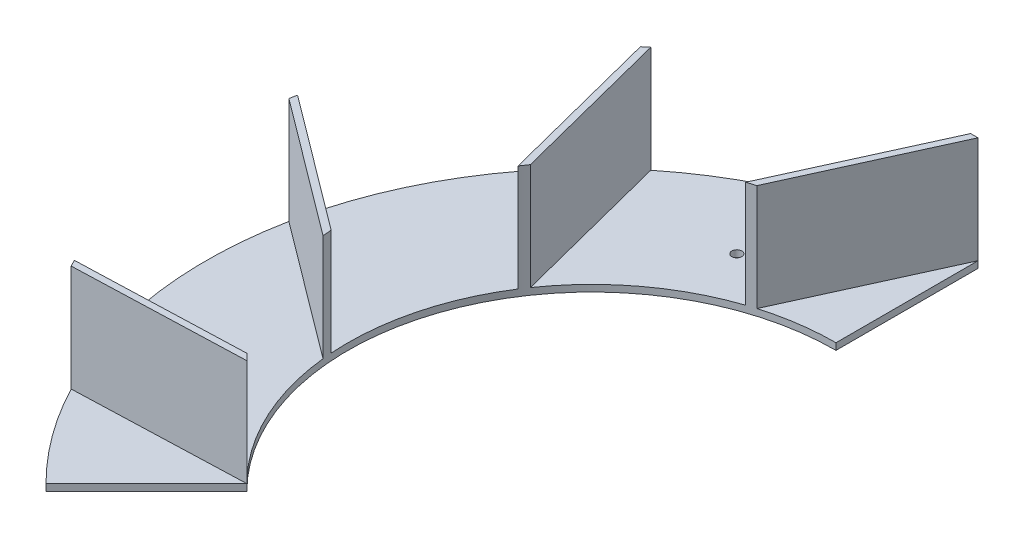
ISO-10303-21;
HEADER;
FILE_DESCRIPTION(('STEP AP214'),'2;1');
FILE_NAME('part.step','',(''),(''),'','','');
FILE_SCHEMA(('AUTOMOTIVE_DESIGN { 1 0 10303 214 1 1 1 1 }'));
ENDSEC;
DATA;
#1=APPLICATION_CONTEXT('core data for automotive mechanical design processes');
#2=APPLICATION_PROTOCOL_DEFINITION('international standard','automotive_design',2000,#1);
#3=PRODUCT_CONTEXT('',#1,'mechanical');
#4=PRODUCT('Part','Part','',(#3));
#5=PRODUCT_RELATED_PRODUCT_CATEGORY('part','',(#4));
#6=PRODUCT_DEFINITION_FORMATION('','',#4);
#7=PRODUCT_DEFINITION_CONTEXT('part definition',#1,'design');
#8=PRODUCT_DEFINITION('design','',#6,#7);
#9=PRODUCT_DEFINITION_SHAPE('','',#8);
#10=(LENGTH_UNIT() NAMED_UNIT(*) SI_UNIT(.MILLI.,.METRE.));
#11=(NAMED_UNIT(*) PLANE_ANGLE_UNIT() SI_UNIT($,.RADIAN.));
#12=(NAMED_UNIT(*) SI_UNIT($,.STERADIAN.) SOLID_ANGLE_UNIT());
#13=UNCERTAINTY_MEASURE_WITH_UNIT(LENGTH_MEASURE(1.E-05),#10,'distance_accuracy_value','');
#14=(GEOMETRIC_REPRESENTATION_CONTEXT(3) GLOBAL_UNCERTAINTY_ASSIGNED_CONTEXT((#13)) GLOBAL_UNIT_ASSIGNED_CONTEXT((#10,
#11,#12)) REPRESENTATION_CONTEXT('',''));
#15=CARTESIAN_POINT('',(0.,0.,0.));
#16=DIRECTION('',(0.,0.,1.));
#17=DIRECTION('',(1.,0.,0.));
#18=AXIS2_PLACEMENT_3D('',#15,#16,#17);
#19=CARTESIAN_POINT('',(0.,3.,0.));
#20=DIRECTION('',(0.,1.,0.));
#21=DIRECTION('',(0.,0.,1.));
#22=AXIS2_PLACEMENT_3D('',#19,#20,#21);
#23=PLANE('',#22);
#24=DIRECTION('',(0.707106781186548,0.,-0.707106781186548));
#25=VECTOR('',#24,1.);
#26=CARTESIAN_POINT('',(-123.036579926459,3.,123.036579926459));
#27=LINE('',#26,#25);
#28=CARTESIAN_POINT('',(-123.036579926459,3.,123.036579926459));
#29=VERTEX_POINT('',#28);
#30=CARTESIAN_POINT('',(-77.7817459305202,3.,77.7817459305202));
#31=VERTEX_POINT('',#30);
#32=EDGE_CURVE('E278',#29,#31,#27,.T.);
#33=ORIENTED_EDGE('',*,*,#32,.T.);
#34=DIRECTION('',(0.999396208274499,0.,-0.0347450555698799));
#35=VECTOR('',#34,1.);
#36=CARTESIAN_POINT('',(-77.7817459305202,3.,77.7817459305202));
#37=LINE('',#36,#35);
#38=CARTESIAN_POINT('',(-154.289169818506,3.,80.4416066268961));
#39=VERTEX_POINT('',#38);
#40=EDGE_CURVE('E50',#39,#31,#37,.T.);
#41=ORIENTED_EDGE('',*,*,#40,.F.);
#42=CARTESIAN_POINT('',(0.,3.,0.));
#43=DIRECTION('',(0.,1.,0.));
#44=DIRECTION('',(0.,0.,1.));
#45=AXIS2_PLACEMENT_3D('',#42,#43,#44);
#46=CIRCLE('',#45,174.);
#47=EDGE_CURVE('E190',#39,#29,#46,.T.);
#48=ORIENTED_EDGE('',*,*,#47,.T.);
#49=EDGE_LOOP('',(#33,#41,#48));
#50=FACE_BOUND('',#49,.T.);
#51=ADVANCED_FACE('F35',(#50),#23,.T.);
#52=CARTESIAN_POINT('',(-130.399986549024,3.,34.9405710888408));
#53=DIRECTION('',(0.,1.,0.));
#54=DIRECTION('',(0.,0.,1.));
#55=AXIS2_PLACEMENT_3D('',#52,#53,#54);
#56=CIRCLE('',#55,2.25000000000001);
#57=CARTESIAN_POINT('',(-130.399986549024,3.,37.1905710888408));
#58=VERTEX_POINT('',#57);
#59=EDGE_CURVE('E410',#58,#58,#56,.F.);
#60=ORIENTED_EDGE('',*,*,#59,.T.);
#61=EDGE_LOOP('',(#60));
#62=FACE_BOUND('',#61,.T.);
#63=CARTESIAN_POINT('',(-170.63929418909,3.,-34.0327971029312));
#64=VERTEX_POINT('',#63);
#65=CARTESIAN_POINT('',(-155.791483301564,3.,77.4920236585584));
#66=VERTEX_POINT('',#65);
#67=EDGE_CURVE('E58',#64,#66,#46,.T.);
#68=ORIENTED_EDGE('',*,*,#67,.T.);
#69=DIRECTION('',(-0.999396208274499,0.,0.03474505556988));
#70=VECTOR('',#69,1.);
#71=CARTESIAN_POINT('',(-155.791483301564,3.,77.4920236585584));
#72=LINE('',#71,#70);
#73=CARTESIAN_POINT('',(-80.5815980869007,3.,74.8772732527113));
#74=VERTEX_POINT('',#73);
#75=EDGE_CURVE('E186',#74,#66,#72,.T.);
#76=ORIENTED_EDGE('',*,*,#75,.F.);
#77=CARTESIAN_POINT('',(0.,3.,0.));
#78=DIRECTION('',(0.,-1.,0.));
#79=DIRECTION('',(0.,0.,1.));
#80=AXIS2_PLACEMENT_3D('',#77,#78,#79);
#81=CIRCLE('',#80,110.);
#82=CARTESIAN_POINT('',(-109.359791534487,3.,11.8505694181139));
#83=VERTEX_POINT('',#82);
#84=EDGE_CURVE('E282',#74,#83,#81,.T.);
#85=ORIENTED_EDGE('',*,*,#84,.T.);
#86=DIRECTION('',(0.800477907707651,0.,0.599362260466891));
#87=VECTOR('',#86,1.);
#88=CARTESIAN_POINT('',(-109.359791534487,3.,11.8505694181139));
#89=LINE('',#88,#87);
#90=EDGE_CURVE('E191',#64,#83,#89,.T.);
#91=ORIENTED_EDGE('',*,*,#90,.F.);
#92=EDGE_LOOP('',(#68,#76,#85,#91));
#93=FACE_BOUND('',#92,.T.);
#94=ADVANCED_FACE('F357',(#62,#93),#23,.T.);
#95=CARTESIAN_POINT('',(-111.624769164457,3.,-133.476255974543));
#96=VERTEX_POINT('',#95);
#97=CARTESIAN_POINT('',(-169.961014343333,3.,-37.2726924622486));
#98=VERTEX_POINT('',#97);
#99=EDGE_CURVE('E279',#96,#98,#46,.T.);
#100=ORIENTED_EDGE('',*,*,#99,.T.);
#101=DIRECTION('',(-0.800477907707652,0.,-0.59936226046689));
#102=VECTOR('',#101,1.);
#103=CARTESIAN_POINT('',(-169.961014343333,3.,-37.2726924622486));
#104=LINE('',#103,#102);
#105=CARTESIAN_POINT('',(-109.72079023891,3.,7.83250849658325));
#106=VERTEX_POINT('',#105);
#107=EDGE_CURVE('E194',#106,#98,#104,.T.);
#108=ORIENTED_EDGE('',*,*,#107,.F.);
#109=CARTESIAN_POINT('',(-92.6379283390326,3.,-59.3145364396643));
#110=VERTEX_POINT('',#109);
#111=EDGE_CURVE('E285',#106,#110,#81,.T.);
#112=ORIENTED_EDGE('',*,*,#111,.T.);
#113=DIRECTION('',(0.248020071304741,0.,0.968754893783764));
#114=VECTOR('',#113,1.);
#115=CARTESIAN_POINT('',(-92.6379283390325,3.,-59.3145364396644));
#116=LINE('',#115,#114);
#117=EDGE_CURVE('E223',#96,#110,#116,.T.);
#118=ORIENTED_EDGE('',*,*,#117,.F.);
#119=EDGE_LOOP('',(#100,#108,#112,#118));
#120=FACE_BOUND('',#119,.T.);
#121=ADVANCED_FACE('F333',(#120),#23,.T.);
#122=CARTESIAN_POINT('',(-57.0534653349945,3.,-122.351551249948));
#123=DIRECTION('',(0.,1.,0.));
#124=DIRECTION('',(0.,0.,1.));
#125=AXIS2_PLACEMENT_3D('',#122,#123,#124);
#126=CIRCLE('',#125,2.25);
#127=CARTESIAN_POINT('',(-57.0534653349945,3.,-120.101551249948));
#128=VERTEX_POINT('',#127);
#129=EDGE_CURVE('E376',#128,#128,#126,.F.);
#130=ORIENTED_EDGE('',*,*,#129,.T.);
#131=EDGE_LOOP('',(#130));
#132=FACE_BOUND('',#131,.T.);
#133=CARTESIAN_POINT('',(-3.30998400994291,3.,-173.968514409516));
#134=VERTEX_POINT('',#133);
#135=CARTESIAN_POINT('',(-109.065465458982,3.,-135.575529665997));
#136=VERTEX_POINT('',#135);
#137=EDGE_CURVE('E275',#134,#136,#46,.T.);
#138=ORIENTED_EDGE('',*,*,#137,.T.);
#139=DIRECTION('',(-0.248020071304741,0.,-0.968754893783764));
#140=VECTOR('',#139,1.);
#141=CARTESIAN_POINT('',(-109.065465458982,3.,-135.575529665997));
#142=LINE('',#141,#140);
#143=CARTESIAN_POINT('',(-90.4006346948465,3.,-62.6715664936573));
#144=VERTEX_POINT('',#143);
#145=EDGE_CURVE('E228',#144,#136,#142,.T.);
#146=ORIENTED_EDGE('',*,*,#145,.F.);
#147=CARTESIAN_POINT('',(-35.0015441175245,3.,-104.282749816971));
#148=VERTEX_POINT('',#147);
#149=EDGE_CURVE('E326',#144,#148,#81,.T.);
#150=ORIENTED_EDGE('',*,*,#149,.T.);
#151=DIRECTION('',(-0.41397845328307,0.,0.910286680237252));
#152=VECTOR('',#151,1.);
#153=CARTESIAN_POINT('',(-35.0015441175245,3.,-104.282749816971));
#154=LINE('',#153,#152);
#155=EDGE_CURVE('E247',#134,#148,#154,.T.);
#156=ORIENTED_EDGE('',*,*,#155,.F.);
#157=EDGE_LOOP('',(#138,#146,#150,#156));
#158=FACE_BOUND('',#157,.T.);
#159=ADVANCED_FACE('F366',(#132,#158),#23,.T.);
#160=DIRECTION('',(0.41397845328307,0.,-0.910286680237252));
#161=VECTOR('',#160,1.);
#162=CARTESIAN_POINT('',(0.,3.,-174.));
#163=LINE('',#162,#161);
#164=CARTESIAN_POINT('',(-31.1540825300106,3.,-105.496081167564));
#165=VERTEX_POINT('',#164);
#166=CARTESIAN_POINT('',(0.,3.,-174.));
#167=VERTEX_POINT('',#166);
#168=EDGE_CURVE('E252',#165,#167,#163,.T.);
#169=ORIENTED_EDGE('',*,*,#168,.F.);
#170=CARTESIAN_POINT('',(0.,3.,-110.));
#171=VERTEX_POINT('',#170);
#172=EDGE_CURVE('E281',#165,#171,#81,.T.);
#173=ORIENTED_EDGE('',*,*,#172,.T.);
#174=DIRECTION('',(0.,0.,-1.));
#175=VECTOR('',#174,1.);
#176=CARTESIAN_POINT('',(0.,3.,-110.));
#177=LINE('',#176,#175);
#178=EDGE_CURVE('E284',#171,#167,#177,.T.);
#179=ORIENTED_EDGE('',*,*,#178,.T.);
#180=EDGE_LOOP('',(#169,#173,#179));
#181=FACE_BOUND('',#180,.T.);
#182=ADVANCED_FACE('F324',(#181),#23,.T.);
#183=CARTESIAN_POINT('',(0.,3.,0.));
#184=DIRECTION('',(0.,-1.,0.));
#185=DIRECTION('',(0.,0.,-1.));
#186=AXIS2_PLACEMENT_3D('',#183,#184,#185);
#187=CYLINDRICAL_SURFACE('',#186,174.);
#188=CARTESIAN_POINT('',(0.,0.,0.));
#189=DIRECTION('',(0.,1.,0.));
#190=DIRECTION('',(0.,0.,1.));
#191=AXIS2_PLACEMENT_3D('',#188,#189,#190);
#192=CIRCLE('',#191,174.);
#193=CARTESIAN_POINT('',(0.,0.,-174.));
#194=VERTEX_POINT('',#193);
#195=CARTESIAN_POINT('',(-123.036579926459,0.,123.036579926459));
#196=VERTEX_POINT('',#195);
#197=EDGE_CURVE('E274',#194,#196,#192,.T.);
#198=ORIENTED_EDGE('',*,*,#197,.T.);
#199=DIRECTION('',(0.,-1.,0.));
#200=VECTOR('',#199,1.);
#201=CARTESIAN_POINT('',(-123.036579926459,3.,123.036579926459));
#202=LINE('',#201,#200);
#203=EDGE_CURVE('E11',#29,#196,#202,.T.);
#204=ORIENTED_EDGE('',*,*,#203,.F.);
#205=ORIENTED_EDGE('',*,*,#47,.F.);
#206=DIRECTION('',(0.,-1.,0.));
#207=VECTOR('',#206,1.);
#208=CARTESIAN_POINT('',(-154.289169818506,51.,80.4416066268961));
#209=LINE('',#208,#207);
#210=CARTESIAN_POINT('',(-154.289169818506,51.,80.4416066268961));
#211=VERTEX_POINT('',#210);
#212=EDGE_CURVE('E171',#211,#39,#209,.T.);
#213=ORIENTED_EDGE('',*,*,#212,.F.);
#214=CARTESIAN_POINT('',(0.,51.,0.));
#215=DIRECTION('',(0.,1.,0.));
#216=DIRECTION('',(0.,0.,1.));
#217=AXIS2_PLACEMENT_3D('',#214,#215,#216);
#218=CIRCLE('',#217,174.);
#219=CARTESIAN_POINT('',(-155.791483301564,51.,77.4920236585584));
#220=VERTEX_POINT('',#219);
#221=EDGE_CURVE('E177',#220,#211,#218,.T.);
#222=ORIENTED_EDGE('',*,*,#221,.F.);
#223=DIRECTION('',(0.,-1.,0.));
#224=VECTOR('',#223,1.);
#225=CARTESIAN_POINT('',(-155.791483301564,51.,77.4920236585584));
#226=LINE('',#225,#224);
#227=EDGE_CURVE('E419',#220,#66,#226,.T.);
#228=ORIENTED_EDGE('',*,*,#227,.T.);
#229=ORIENTED_EDGE('',*,*,#67,.F.);
#230=DIRECTION('',(0.,-1.,0.));
#231=VECTOR('',#230,1.);
#232=CARTESIAN_POINT('',(-170.63929418909,51.,-34.0327971029312));
#233=LINE('',#232,#231);
#234=CARTESIAN_POINT('',(-170.63929418909,51.,-34.0327971029312));
#235=VERTEX_POINT('',#234);
#236=EDGE_CURVE('E220',#235,#64,#233,.T.);
#237=ORIENTED_EDGE('',*,*,#236,.F.);
#238=CARTESIAN_POINT('',(0.,51.,0.));
#239=DIRECTION('',(0.,1.,0.));
#240=DIRECTION('',(0.,0.,1.));
#241=AXIS2_PLACEMENT_3D('',#238,#239,#240);
#242=CIRCLE('',#241,174.);
#243=CARTESIAN_POINT('',(-169.961014343333,51.,-37.2726924622486));
#244=VERTEX_POINT('',#243);
#245=EDGE_CURVE('E200',#244,#235,#242,.T.);
#246=ORIENTED_EDGE('',*,*,#245,.F.);
#247=DIRECTION('',(0.,-1.,0.));
#248=VECTOR('',#247,1.);
#249=CARTESIAN_POINT('',(-169.961014343333,51.,-37.2726924622486));
#250=LINE('',#249,#248);
#251=EDGE_CURVE('E208',#244,#98,#250,.T.);
#252=ORIENTED_EDGE('',*,*,#251,.T.);
#253=ORIENTED_EDGE('',*,*,#99,.F.);
#254=DIRECTION('',(0.,-1.,0.));
#255=VECTOR('',#254,1.);
#256=CARTESIAN_POINT('',(-111.624769164457,51.,-133.476255974543));
#257=LINE('',#256,#255);
#258=CARTESIAN_POINT('',(-111.624769164457,51.,-133.476255974543));
#259=VERTEX_POINT('',#258);
#260=EDGE_CURVE('E245',#259,#96,#257,.T.);
#261=ORIENTED_EDGE('',*,*,#260,.F.);
#262=CARTESIAN_POINT('',(0.,51.,0.));
#263=DIRECTION('',(0.,1.,0.));
#264=DIRECTION('',(0.,0.,1.));
#265=AXIS2_PLACEMENT_3D('',#262,#263,#264);
#266=CIRCLE('',#265,174.);
#267=CARTESIAN_POINT('',(-109.065465458982,51.,-135.575529665997));
#268=VERTEX_POINT('',#267);
#269=EDGE_CURVE('E224',#268,#259,#266,.T.);
#270=ORIENTED_EDGE('',*,*,#269,.F.);
#271=DIRECTION('',(0.,-1.,0.));
#272=VECTOR('',#271,1.);
#273=CARTESIAN_POINT('',(-109.065465458982,51.,-135.575529665997));
#274=LINE('',#273,#272);
#275=EDGE_CURVE('E234',#268,#136,#274,.T.);
#276=ORIENTED_EDGE('',*,*,#275,.T.);
#277=ORIENTED_EDGE('',*,*,#137,.F.);
#278=DIRECTION('',(0.,-1.,0.));
#279=VECTOR('',#278,1.);
#280=CARTESIAN_POINT('',(-3.30998400994292,51.,-173.968514409516));
#281=LINE('',#280,#279);
#282=CARTESIAN_POINT('',(-3.30998400994292,51.,-173.968514409516));
#283=VERTEX_POINT('',#282);
#284=EDGE_CURVE('E271',#283,#134,#281,.T.);
#285=ORIENTED_EDGE('',*,*,#284,.F.);
#286=CARTESIAN_POINT('',(0.,51.,0.));
#287=DIRECTION('',(0.,1.,0.));
#288=DIRECTION('',(0.,0.,1.));
#289=AXIS2_PLACEMENT_3D('',#286,#287,#288);
#290=CIRCLE('',#289,174.);
#291=CARTESIAN_POINT('',(0.,51.,-174.));
#292=VERTEX_POINT('',#291);
#293=EDGE_CURVE('E248',#292,#283,#290,.T.);
#294=ORIENTED_EDGE('',*,*,#293,.F.);
#295=DIRECTION('',(0.,-1.,0.));
#296=VECTOR('',#295,1.);
#297=CARTESIAN_POINT('',(0.,51.,-174.));
#298=LINE('',#297,#296);
#299=EDGE_CURVE('E258',#292,#167,#298,.T.);
#300=ORIENTED_EDGE('',*,*,#299,.T.);
#301=DIRECTION('',(0.,-1.,0.));
#302=VECTOR('',#301,1.);
#303=CARTESIAN_POINT('',(0.,3.,-174.));
#304=LINE('',#303,#302);
#305=EDGE_CURVE('E287',#167,#194,#304,.T.);
#306=ORIENTED_EDGE('',*,*,#305,.T.);
#307=EDGE_LOOP('',(#198,#204,#205,#213,#222,#228,#229,#237,#246,#252,#253,#261,#270,#276,#277,
#285,#294,#300,#306));
#308=FACE_BOUND('',#307,.T.);
#309=ADVANCED_FACE('F37',(#308),#187,.T.);
#310=CARTESIAN_POINT('',(-123.036579926459,3.,123.036579926459));
#311=DIRECTION('',(-0.707106781186547,0.,-0.707106781186547));
#312=DIRECTION('',(-0.707106781186548,0.,0.707106781186548));
#313=AXIS2_PLACEMENT_3D('',#310,#311,#312);
#314=PLANE('',#313);
#315=DIRECTION('',(0.707106781186548,0.,-0.707106781186548));
#316=VECTOR('',#315,1.);
#317=CARTESIAN_POINT('',(-123.036579926459,0.,123.036579926459));
#318=LINE('',#317,#316);
#319=CARTESIAN_POINT('',(-77.7817459305202,0.,77.7817459305202));
#320=VERTEX_POINT('',#319);
#321=EDGE_CURVE('E289',#196,#320,#318,.T.);
#322=ORIENTED_EDGE('',*,*,#321,.T.);
#323=DIRECTION('',(0.,-1.,0.));
#324=VECTOR('',#323,1.);
#325=CARTESIAN_POINT('',(-77.7817459305202,3.,77.7817459305202));
#326=LINE('',#325,#324);
#327=EDGE_CURVE('E43',#31,#320,#326,.T.);
#328=ORIENTED_EDGE('',*,*,#327,.F.);
#329=ORIENTED_EDGE('',*,*,#32,.F.);
#330=ORIENTED_EDGE('',*,*,#203,.T.);
#331=EDGE_LOOP('',(#322,#328,#329,#330));
#332=FACE_BOUND('',#331,.T.);
#333=ADVANCED_FACE('F349',(#332),#314,.F.);
#334=CARTESIAN_POINT('',(0.,3.,0.));
#335=DIRECTION('',(0.,-1.,0.));
#336=DIRECTION('',(0.,0.,-1.));
#337=AXIS2_PLACEMENT_3D('',#334,#335,#336);
#338=CYLINDRICAL_SURFACE('',#337,110.);
#339=CARTESIAN_POINT('',(0.,0.,0.));
#340=DIRECTION('',(0.,-1.,0.));
#341=DIRECTION('',(0.,0.,1.));
#342=AXIS2_PLACEMENT_3D('',#339,#340,#341);
#343=CIRCLE('',#342,110.);
#344=CARTESIAN_POINT('',(0.,0.,-110.));
#345=VERTEX_POINT('',#344);
#346=EDGE_CURVE('E291',#320,#345,#343,.T.);
#347=ORIENTED_EDGE('',*,*,#346,.T.);
#348=DIRECTION('',(0.,-1.,0.));
#349=VECTOR('',#348,1.);
#350=CARTESIAN_POINT('',(0.,3.,-110.));
#351=LINE('',#350,#349);
#352=EDGE_CURVE('E297',#171,#345,#351,.T.);
#353=ORIENTED_EDGE('',*,*,#352,.F.);
#354=ORIENTED_EDGE('',*,*,#172,.F.);
#355=DIRECTION('',(0.,-1.,0.));
#356=VECTOR('',#355,1.);
#357=CARTESIAN_POINT('',(-31.1540825300106,51.,-105.496081167564));
#358=LINE('',#357,#356);
#359=CARTESIAN_POINT('',(-31.1540825300106,51.,-105.496081167564));
#360=VERTEX_POINT('',#359);
#361=EDGE_CURVE('E265',#360,#165,#358,.T.);
#362=ORIENTED_EDGE('',*,*,#361,.F.);
#363=CARTESIAN_POINT('',(0.,51.,0.));
#364=DIRECTION('',(0.,-1.,0.));
#365=DIRECTION('',(0.,0.,1.));
#366=AXIS2_PLACEMENT_3D('',#363,#364,#365);
#367=CIRCLE('',#366,110.);
#368=CARTESIAN_POINT('',(-35.0015441175245,51.,-104.282749816971));
#369=VERTEX_POINT('',#368);
#370=EDGE_CURVE('E254',#369,#360,#367,.T.);
#371=ORIENTED_EDGE('',*,*,#370,.F.);
#372=DIRECTION('',(0.,-1.,0.));
#373=VECTOR('',#372,1.);
#374=CARTESIAN_POINT('',(-35.0015441175245,51.,-104.282749816971));
#375=LINE('',#374,#373);
#376=EDGE_CURVE('E268',#369,#148,#375,.T.);
#377=ORIENTED_EDGE('',*,*,#376,.T.);
#378=ORIENTED_EDGE('',*,*,#149,.F.);
#379=DIRECTION('',(0.,-1.,0.));
#380=VECTOR('',#379,1.);
#381=CARTESIAN_POINT('',(-90.4006346948465,51.,-62.6715664936573));
#382=LINE('',#381,#380);
#383=CARTESIAN_POINT('',(-90.4006346948465,51.,-62.6715664936573));
#384=VERTEX_POINT('',#383);
#385=EDGE_CURVE('E240',#384,#144,#382,.T.);
#386=ORIENTED_EDGE('',*,*,#385,.F.);
#387=CARTESIAN_POINT('',(0.,51.,0.));
#388=DIRECTION('',(0.,-1.,0.));
#389=DIRECTION('',(0.,0.,1.));
#390=AXIS2_PLACEMENT_3D('',#387,#388,#389);
#391=CIRCLE('',#390,110.);
#392=CARTESIAN_POINT('',(-92.6379283390326,51.,-59.3145364396643));
#393=VERTEX_POINT('',#392);
#394=EDGE_CURVE('E230',#393,#384,#391,.T.);
#395=ORIENTED_EDGE('',*,*,#394,.F.);
#396=DIRECTION('',(0.,-1.,0.));
#397=VECTOR('',#396,1.);
#398=CARTESIAN_POINT('',(-92.6379283390326,51.,-59.3145364396643));
#399=LINE('',#398,#397);
#400=EDGE_CURVE('E242',#393,#110,#399,.T.);
#401=ORIENTED_EDGE('',*,*,#400,.T.);
#402=ORIENTED_EDGE('',*,*,#111,.F.);
#403=DIRECTION('',(0.,-1.,0.));
#404=VECTOR('',#403,1.);
#405=CARTESIAN_POINT('',(-109.72079023891,51.,7.83250849658325));
#406=LINE('',#405,#404);
#407=CARTESIAN_POINT('',(-109.72079023891,51.,7.83250849658325));
#408=VERTEX_POINT('',#407);
#409=EDGE_CURVE('E214',#408,#106,#406,.T.);
#410=ORIENTED_EDGE('',*,*,#409,.F.);
#411=CARTESIAN_POINT('',(0.,51.,0.));
#412=DIRECTION('',(0.,-1.,0.));
#413=DIRECTION('',(0.,0.,1.));
#414=AXIS2_PLACEMENT_3D('',#411,#412,#413);
#415=CIRCLE('',#414,110.);
#416=CARTESIAN_POINT('',(-109.359791534487,51.,11.8505694181139));
#417=VERTEX_POINT('',#416);
#418=EDGE_CURVE('E205',#417,#408,#415,.T.);
#419=ORIENTED_EDGE('',*,*,#418,.F.);
#420=DIRECTION('',(0.,-1.,0.));
#421=VECTOR('',#420,1.);
#422=CARTESIAN_POINT('',(-109.359791534487,51.,11.8505694181139));
#423=LINE('',#422,#421);
#424=EDGE_CURVE('E217',#417,#83,#423,.T.);
#425=ORIENTED_EDGE('',*,*,#424,.T.);
#426=ORIENTED_EDGE('',*,*,#84,.F.);
#427=DIRECTION('',(0.,-1.,0.));
#428=VECTOR('',#427,1.);
#429=CARTESIAN_POINT('',(-80.5815980869007,51.,74.8772732527113));
#430=LINE('',#429,#428);
#431=CARTESIAN_POINT('',(-80.5815980869007,51.,74.8772732527113));
#432=VERTEX_POINT('',#431);
#433=EDGE_CURVE('E196',#432,#74,#430,.T.);
#434=ORIENTED_EDGE('',*,*,#433,.F.);
#435=CARTESIAN_POINT('',(0.,51.,0.));
#436=DIRECTION('',(0.,-1.,0.));
#437=DIRECTION('',(0.,0.,1.));
#438=AXIS2_PLACEMENT_3D('',#435,#436,#437);
#439=CIRCLE('',#438,110.);
#440=CARTESIAN_POINT('',(-77.7817459305202,51.,77.7817459305202));
#441=VERTEX_POINT('',#440);
#442=EDGE_CURVE('E176',#441,#432,#439,.T.);
#443=ORIENTED_EDGE('',*,*,#442,.F.);
#444=DIRECTION('',(0.,-1.,0.));
#445=VECTOR('',#444,1.);
#446=CARTESIAN_POINT('',(-77.7817459305202,51.,77.7817459305202));
#447=LINE('',#446,#445);
#448=EDGE_CURVE('E173',#441,#31,#447,.T.);
#449=ORIENTED_EDGE('',*,*,#448,.T.);
#450=ORIENTED_EDGE('',*,*,#327,.T.);
#451=EDGE_LOOP('',(#347,#353,#354,#362,#371,#377,#378,#386,#395,#401,#402,#410,#419,#425,#426,
#434,#443,#449,#450));
#452=FACE_BOUND('',#451,.T.);
#453=ADVANCED_FACE('F303',(#452),#338,.F.);
#454=CARTESIAN_POINT('',(0.,3.,-110.));
#455=DIRECTION('',(-1.,0.,0.));
#456=DIRECTION('',(0.,0.,1.));
#457=AXIS2_PLACEMENT_3D('',#454,#455,#456);
#458=PLANE('',#457);
#459=DIRECTION('',(0.,0.,-1.));
#460=VECTOR('',#459,1.);
#461=CARTESIAN_POINT('',(0.,0.,-110.));
#462=LINE('',#461,#460);
#463=EDGE_CURVE('E293',#345,#194,#462,.T.);
#464=ORIENTED_EDGE('',*,*,#463,.T.);
#465=ORIENTED_EDGE('',*,*,#305,.F.);
#466=ORIENTED_EDGE('',*,*,#178,.F.);
#467=ORIENTED_EDGE('',*,*,#352,.T.);
#468=EDGE_LOOP('',(#464,#465,#466,#467));
#469=FACE_BOUND('',#468,.T.);
#470=ADVANCED_FACE('F313',(#469),#458,.F.);
#471=CARTESIAN_POINT('',(0.,0.,0.));
#472=DIRECTION('',(0.,1.,0.));
#473=DIRECTION('',(0.,0.,1.));
#474=AXIS2_PLACEMENT_3D('',#471,#472,#473);
#475=PLANE('',#474);
#476=CARTESIAN_POINT('',(-57.0534653349945,0.,-122.351551249948));
#477=DIRECTION('',(0.,-1.,0.));
#478=DIRECTION('',(0.,0.,-1.));
#479=AXIS2_PLACEMENT_3D('',#476,#477,#478);
#480=CIRCLE('',#479,2.25);
#481=CARTESIAN_POINT('',(-57.0534653349945,0.,-124.601551249948));
#482=VERTEX_POINT('',#481);
#483=EDGE_CURVE('E405',#482,#482,#480,.T.);
#484=ORIENTED_EDGE('',*,*,#483,.F.);
#485=EDGE_LOOP('',(#484));
#486=FACE_BOUND('',#485,.T.);
#487=CARTESIAN_POINT('',(-130.399986549024,0.,34.9405710888408));
#488=DIRECTION('',(0.,-1.,0.));
#489=DIRECTION('',(0.,0.,-1.));
#490=AXIS2_PLACEMENT_3D('',#487,#488,#489);
#491=CIRCLE('',#490,2.25000000000001);
#492=CARTESIAN_POINT('',(-130.399986549024,0.,32.6905710888408));
#493=VERTEX_POINT('',#492);
#494=EDGE_CURVE('E408',#493,#493,#491,.T.);
#495=ORIENTED_EDGE('',*,*,#494,.F.);
#496=EDGE_LOOP('',(#495));
#497=FACE_BOUND('',#496,.T.);
#498=ORIENTED_EDGE('',*,*,#197,.F.);
#499=ORIENTED_EDGE('',*,*,#463,.F.);
#500=ORIENTED_EDGE('',*,*,#346,.F.);
#501=ORIENTED_EDGE('',*,*,#321,.F.);
#502=EDGE_LOOP('',(#498,#499,#500,#501));
#503=FACE_BOUND('',#502,.T.);
#504=ADVANCED_FACE('F310',(#486,#497,#503),#475,.F.);
#505=CARTESIAN_POINT('',(-35.0015441175245,51.,-104.282749816971));
#506=DIRECTION('',(0.910286680237252,0.,0.41397845328307));
#507=DIRECTION('',(0.41397845328307,0.,-0.910286680237252));
#508=AXIS2_PLACEMENT_3D('',#505,#506,#507);
#509=PLANE('',#508);
#510=ORIENTED_EDGE('',*,*,#155,.T.);
#511=ORIENTED_EDGE('',*,*,#376,.F.);
#512=DIRECTION('',(-0.41397845328307,0.,0.910286680237252));
#513=VECTOR('',#512,1.);
#514=CARTESIAN_POINT('',(-35.0015441175245,51.,-104.282749816971));
#515=LINE('',#514,#513);
#516=EDGE_CURVE('E251',#283,#369,#515,.T.);
#517=ORIENTED_EDGE('',*,*,#516,.F.);
#518=ORIENTED_EDGE('',*,*,#284,.T.);
#519=EDGE_LOOP('',(#510,#511,#517,#518));
#520=FACE_BOUND('',#519,.T.);
#521=ADVANCED_FACE('F379',(#520),#509,.F.);
#522=CARTESIAN_POINT('',(0.,51.,-174.));
#523=DIRECTION('',(-0.910286680237252,0.,-0.41397845328307));
#524=DIRECTION('',(-0.41397845328307,0.,0.910286680237252));
#525=AXIS2_PLACEMENT_3D('',#522,#523,#524);
#526=PLANE('',#525);
#527=ORIENTED_EDGE('',*,*,#168,.T.);
#528=ORIENTED_EDGE('',*,*,#299,.F.);
#529=DIRECTION('',(0.41397845328307,0.,-0.910286680237252));
#530=VECTOR('',#529,1.);
#531=CARTESIAN_POINT('',(0.,51.,-174.));
#532=LINE('',#531,#530);
#533=EDGE_CURVE('E256',#360,#292,#532,.T.);
#534=ORIENTED_EDGE('',*,*,#533,.F.);
#535=ORIENTED_EDGE('',*,*,#361,.T.);
#536=EDGE_LOOP('',(#527,#528,#534,#535));
#537=FACE_BOUND('',#536,.T.);
#538=ADVANCED_FACE('F320',(#537),#526,.F.);
#539=CARTESIAN_POINT('',(0.,51.,0.));
#540=DIRECTION('',(0.,1.,0.));
#541=DIRECTION('',(0.,0.,1.));
#542=AXIS2_PLACEMENT_3D('',#539,#540,#541);
#543=PLANE('',#542);
#544=ORIENTED_EDGE('',*,*,#293,.T.);
#545=ORIENTED_EDGE('',*,*,#516,.T.);
#546=ORIENTED_EDGE('',*,*,#370,.T.);
#547=ORIENTED_EDGE('',*,*,#533,.T.);
#548=EDGE_LOOP('',(#544,#545,#546,#547));
#549=FACE_BOUND('',#548,.T.);
#550=ADVANCED_FACE('F382',(#549),#543,.T.);
#551=CARTESIAN_POINT('',(-92.6379283390325,51.,-59.3145364396644));
#552=DIRECTION('',(0.968754893783764,0.,-0.248020071304741));
#553=DIRECTION('',(-0.248020071304741,0.,-0.968754893783764));
#554=AXIS2_PLACEMENT_3D('',#551,#552,#553);
#555=PLANE('',#554);
#556=ORIENTED_EDGE('',*,*,#117,.T.);
#557=ORIENTED_EDGE('',*,*,#400,.F.);
#558=DIRECTION('',(0.248020071304741,0.,0.968754893783764));
#559=VECTOR('',#558,1.);
#560=CARTESIAN_POINT('',(-92.6379283390325,51.,-59.3145364396644));
#561=LINE('',#560,#559);
#562=EDGE_CURVE('E227',#259,#393,#561,.T.);
#563=ORIENTED_EDGE('',*,*,#562,.F.);
#564=ORIENTED_EDGE('',*,*,#260,.T.);
#565=EDGE_LOOP('',(#556,#557,#563,#564));
#566=FACE_BOUND('',#565,.T.);
#567=ADVANCED_FACE('F338',(#566),#555,.F.);
#568=CARTESIAN_POINT('',(-109.065465458982,51.,-135.575529665997));
#569=DIRECTION('',(-0.968754893783764,0.,0.248020071304741));
#570=DIRECTION('',(0.248020071304741,0.,0.968754893783764));
#571=AXIS2_PLACEMENT_3D('',#568,#569,#570);
#572=PLANE('',#571);
#573=ORIENTED_EDGE('',*,*,#145,.T.);
#574=ORIENTED_EDGE('',*,*,#275,.F.);
#575=DIRECTION('',(-0.248020071304741,0.,-0.968754893783764));
#576=VECTOR('',#575,1.);
#577=CARTESIAN_POINT('',(-109.065465458982,51.,-135.575529665997));
#578=LINE('',#577,#576);
#579=EDGE_CURVE('E232',#384,#268,#578,.T.);
#580=ORIENTED_EDGE('',*,*,#579,.F.);
#581=ORIENTED_EDGE('',*,*,#385,.T.);
#582=EDGE_LOOP('',(#573,#574,#580,#581));
#583=FACE_BOUND('',#582,.T.);
#584=ADVANCED_FACE('F389',(#583),#572,.F.);
#585=CARTESIAN_POINT('',(0.,51.,0.));
#586=DIRECTION('',(0.,1.,0.));
#587=DIRECTION('',(0.,0.,1.));
#588=AXIS2_PLACEMENT_3D('',#585,#586,#587);
#589=PLANE('',#588);
#590=ORIENTED_EDGE('',*,*,#269,.T.);
#591=ORIENTED_EDGE('',*,*,#562,.T.);
#592=ORIENTED_EDGE('',*,*,#394,.T.);
#593=ORIENTED_EDGE('',*,*,#579,.T.);
#594=EDGE_LOOP('',(#590,#591,#592,#593));
#595=FACE_BOUND('',#594,.T.);
#596=ADVANCED_FACE('F344',(#595),#589,.T.);
#597=CARTESIAN_POINT('',(-109.359791534487,51.,11.8505694181139));
#598=DIRECTION('',(0.599362260466891,0.,-0.800477907707651));
#599=DIRECTION('',(-0.800477907707651,0.,-0.599362260466891));
#600=AXIS2_PLACEMENT_3D('',#597,#598,#599);
#601=PLANE('',#600);
#602=ORIENTED_EDGE('',*,*,#90,.T.);
#603=ORIENTED_EDGE('',*,*,#424,.F.);
#604=DIRECTION('',(0.800477907707651,0.,0.599362260466891));
#605=VECTOR('',#604,1.);
#606=CARTESIAN_POINT('',(-109.359791534487,51.,11.8505694181139));
#607=LINE('',#606,#605);
#608=EDGE_CURVE('E203',#235,#417,#607,.T.);
#609=ORIENTED_EDGE('',*,*,#608,.F.);
#610=ORIENTED_EDGE('',*,*,#236,.T.);
#611=EDGE_LOOP('',(#602,#603,#609,#610));
#612=FACE_BOUND('',#611,.T.);
#613=ADVANCED_FACE('F429',(#612),#601,.F.);
#614=CARTESIAN_POINT('',(-169.961014343333,51.,-37.2726924622486));
#615=DIRECTION('',(-0.59936226046689,0.,0.800477907707651));
#616=DIRECTION('',(0.800477907707652,0.,0.59936226046689));
#617=AXIS2_PLACEMENT_3D('',#614,#615,#616);
#618=PLANE('',#617);
#619=ORIENTED_EDGE('',*,*,#107,.T.);
#620=ORIENTED_EDGE('',*,*,#251,.F.);
#621=DIRECTION('',(-0.800477907707652,0.,-0.59936226046689));
#622=VECTOR('',#621,1.);
#623=CARTESIAN_POINT('',(-169.961014343333,51.,-37.2726924622486));
#624=LINE('',#623,#622);
#625=EDGE_CURVE('E207',#408,#244,#624,.T.);
#626=ORIENTED_EDGE('',*,*,#625,.F.);
#627=ORIENTED_EDGE('',*,*,#409,.T.);
#628=EDGE_LOOP('',(#619,#620,#626,#627));
#629=FACE_BOUND('',#628,.T.);
#630=ADVANCED_FACE('F435',(#629),#618,.F.);
#631=CARTESIAN_POINT('',(0.,51.,0.));
#632=DIRECTION('',(0.,1.,0.));
#633=DIRECTION('',(0.,0.,1.));
#634=AXIS2_PLACEMENT_3D('',#631,#632,#633);
#635=PLANE('',#634);
#636=ORIENTED_EDGE('',*,*,#245,.T.);
#637=ORIENTED_EDGE('',*,*,#608,.T.);
#638=ORIENTED_EDGE('',*,*,#418,.T.);
#639=ORIENTED_EDGE('',*,*,#625,.T.);
#640=EDGE_LOOP('',(#636,#637,#638,#639));
#641=FACE_BOUND('',#640,.T.);
#642=ADVANCED_FACE('F432',(#641),#635,.T.);
#643=CARTESIAN_POINT('',(-77.7817459305202,51.,77.7817459305202));
#644=DIRECTION('',(-0.0347450555698799,0.,-0.999396208274499));
#645=DIRECTION('',(-0.999396208274499,0.,0.0347450555698799));
#646=AXIS2_PLACEMENT_3D('',#643,#644,#645);
#647=PLANE('',#646);
#648=ORIENTED_EDGE('',*,*,#40,.T.);
#649=ORIENTED_EDGE('',*,*,#448,.F.);
#650=DIRECTION('',(0.999396208274499,0.,-0.0347450555698799));
#651=VECTOR('',#650,1.);
#652=CARTESIAN_POINT('',(-77.7817459305202,51.,77.7817459305202));
#653=LINE('',#652,#651);
#654=EDGE_CURVE('E167',#211,#441,#653,.T.);
#655=ORIENTED_EDGE('',*,*,#654,.F.);
#656=ORIENTED_EDGE('',*,*,#212,.T.);
#657=EDGE_LOOP('',(#648,#649,#655,#656));
#658=FACE_BOUND('',#657,.T.);
#659=ADVANCED_FACE('F169',(#658),#647,.F.);
#660=CARTESIAN_POINT('',(-155.791483301564,51.,77.4920236585584));
#661=DIRECTION('',(0.03474505556988,0.,0.999396208274499));
#662=DIRECTION('',(0.999396208274499,0.,-0.03474505556988));
#663=AXIS2_PLACEMENT_3D('',#660,#661,#662);
#664=PLANE('',#663);
#665=ORIENTED_EDGE('',*,*,#75,.T.);
#666=ORIENTED_EDGE('',*,*,#227,.F.);
#667=DIRECTION('',(-0.999396208274499,0.,0.03474505556988));
#668=VECTOR('',#667,1.);
#669=CARTESIAN_POINT('',(-155.791483301564,51.,77.4920236585584));
#670=LINE('',#669,#668);
#671=EDGE_CURVE('E182',#432,#220,#670,.T.);
#672=ORIENTED_EDGE('',*,*,#671,.F.);
#673=ORIENTED_EDGE('',*,*,#433,.T.);
#674=EDGE_LOOP('',(#665,#666,#672,#673));
#675=FACE_BOUND('',#674,.T.);
#676=ADVANCED_FACE('F425',(#675),#664,.F.);
#677=CARTESIAN_POINT('',(0.,51.,0.));
#678=DIRECTION('',(0.,1.,0.));
#679=DIRECTION('',(0.,0.,1.));
#680=AXIS2_PLACEMENT_3D('',#677,#678,#679);
#681=PLANE('',#680);
#682=ORIENTED_EDGE('',*,*,#221,.T.);
#683=ORIENTED_EDGE('',*,*,#654,.T.);
#684=ORIENTED_EDGE('',*,*,#442,.T.);
#685=ORIENTED_EDGE('',*,*,#671,.T.);
#686=EDGE_LOOP('',(#682,#683,#684,#685));
#687=FACE_BOUND('',#686,.T.);
#688=ADVANCED_FACE('F180',(#687),#681,.T.);
#689=CARTESIAN_POINT('',(-130.399986549024,51.001,34.9405710888408));
#690=DIRECTION('',(0.,-1.,0.));
#691=DIRECTION('',(0.,0.,-1.));
#692=AXIS2_PLACEMENT_3D('',#689,#690,#691);
#693=CYLINDRICAL_SURFACE('',#692,2.25000000000001);
#694=ORIENTED_EDGE('',*,*,#59,.F.);
#695=EDGE_LOOP('',(#694));
#696=FACE_BOUND('',#695,.T.);
#697=ORIENTED_EDGE('',*,*,#494,.T.);
#698=EDGE_LOOP('',(#697));
#699=FACE_BOUND('',#698,.T.);
#700=ADVANCED_FACE('F495',(#696,#699),#693,.F.);
#701=CARTESIAN_POINT('',(-57.0534653349945,51.001,-122.351551249948));
#702=DIRECTION('',(0.,-1.,0.));
#703=DIRECTION('',(0.,0.,-1.));
#704=AXIS2_PLACEMENT_3D('',#701,#702,#703);
#705=CYLINDRICAL_SURFACE('',#704,2.25);
#706=ORIENTED_EDGE('',*,*,#129,.F.);
#707=EDGE_LOOP('',(#706));
#708=FACE_BOUND('',#707,.T.);
#709=ORIENTED_EDGE('',*,*,#483,.T.);
#710=EDGE_LOOP('',(#709));
#711=FACE_BOUND('',#710,.T.);
#712=ADVANCED_FACE('F522',(#708,#711),#705,.F.);
#713=CLOSED_SHELL('',(#51,#94,#121,#159,#182,#309,#333,#453,#470,#504,#521,#538,#550,#567,#584,
#596,#613,#630,#642,#659,#676,#688,#700,#712));
#714=MANIFOLD_SOLID_BREP('B2',#713);
#715=ADVANCED_BREP_SHAPE_REPRESENTATION('',(#18,#714),#14);
#716=SHAPE_DEFINITION_REPRESENTATION(#9,#715);
ENDSEC;
END-ISO-10303-21;
